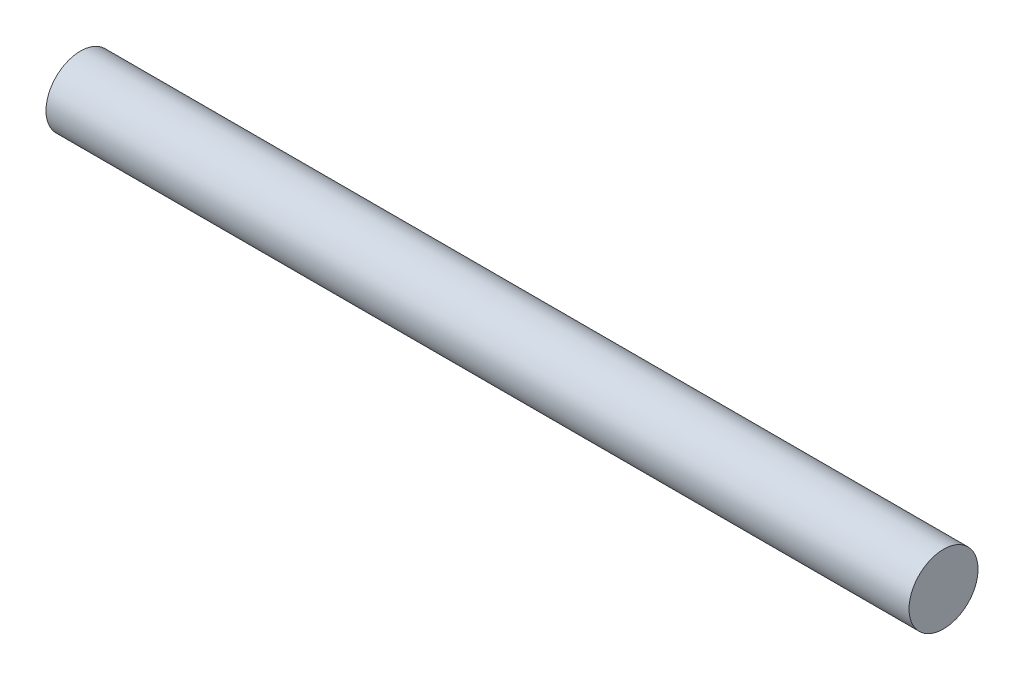
ISO-10303-21;
HEADER;
FILE_DESCRIPTION(('STEP AP214'),'2;1');
FILE_NAME('part.step','',(''),(''),'','','');
FILE_SCHEMA(('AUTOMOTIVE_DESIGN { 1 0 10303 214 1 1 1 1 }'));
ENDSEC;
DATA;
#1=APPLICATION_CONTEXT('core data for automotive mechanical design processes');
#2=APPLICATION_PROTOCOL_DEFINITION('international standard','automotive_design',2000,#1);
#3=PRODUCT_CONTEXT('',#1,'mechanical');
#4=PRODUCT('Part','Part','',(#3));
#5=PRODUCT_RELATED_PRODUCT_CATEGORY('part','',(#4));
#6=PRODUCT_DEFINITION_FORMATION('','',#4);
#7=PRODUCT_DEFINITION_CONTEXT('part definition',#1,'design');
#8=PRODUCT_DEFINITION('design','',#6,#7);
#9=PRODUCT_DEFINITION_SHAPE('','',#8);
#10=(LENGTH_UNIT() NAMED_UNIT(*) SI_UNIT(.MILLI.,.METRE.));
#11=(NAMED_UNIT(*) PLANE_ANGLE_UNIT() SI_UNIT($,.RADIAN.));
#12=(NAMED_UNIT(*) SI_UNIT($,.STERADIAN.) SOLID_ANGLE_UNIT());
#13=UNCERTAINTY_MEASURE_WITH_UNIT(LENGTH_MEASURE(1.E-05),#10,'distance_accuracy_value','');
#14=(GEOMETRIC_REPRESENTATION_CONTEXT(3) GLOBAL_UNCERTAINTY_ASSIGNED_CONTEXT((#13)) GLOBAL_UNIT_ASSIGNED_CONTEXT((#10,
#11,#12)) REPRESENTATION_CONTEXT('',''));
#15=CARTESIAN_POINT('',(0.,0.,0.));
#16=DIRECTION('',(0.,0.,1.));
#17=DIRECTION('',(1.,0.,0.));
#18=AXIS2_PLACEMENT_3D('',#15,#16,#17);
#19=CARTESIAN_POINT('',(0.,0.,0.));
#20=DIRECTION('',(1.,0.,0.));
#21=DIRECTION('',(0.,0.,-1.));
#22=AXIS2_PLACEMENT_3D('',#19,#20,#21);
#23=PLANE('',#22);
#24=CARTESIAN_POINT('',(0.,0.,0.));
#25=DIRECTION('',(-1.,0.,0.));
#26=DIRECTION('',(0.,0.,1.));
#27=AXIS2_PLACEMENT_3D('',#24,#25,#26);
#28=CIRCLE('',#27,4.);
#29=CARTESIAN_POINT('',(0.,0.,4.));
#30=VERTEX_POINT('',#29);
#31=EDGE_CURVE('E10',#30,#30,#28,.T.);
#32=ORIENTED_EDGE('',*,*,#31,.T.);
#33=EDGE_LOOP('',(#32));
#34=FACE_BOUND('',#33,.T.);
#35=ADVANCED_FACE('F30',(#34),#23,.F.);
#36=CARTESIAN_POINT('',(0.,0.,0.));
#37=DIRECTION('',(-1.,0.,0.));
#38=DIRECTION('',(0.,0.,1.));
#39=AXIS2_PLACEMENT_3D('',#36,#37,#38);
#40=CYLINDRICAL_SURFACE('',#39,4.);
#41=ORIENTED_EDGE('',*,*,#31,.F.);
#42=EDGE_LOOP('',(#41));
#43=FACE_BOUND('',#42,.T.);
#44=CARTESIAN_POINT('',(100.,0.,0.));
#45=DIRECTION('',(-1.,0.,0.));
#46=DIRECTION('',(0.,0.,1.));
#47=AXIS2_PLACEMENT_3D('',#44,#45,#46);
#48=CIRCLE('',#47,4.);
#49=CARTESIAN_POINT('',(100.,0.,4.));
#50=VERTEX_POINT('',#49);
#51=EDGE_CURVE('E36',#50,#50,#48,.T.);
#52=ORIENTED_EDGE('',*,*,#51,.T.);
#53=EDGE_LOOP('',(#52));
#54=FACE_BOUND('',#53,.T.);
#55=ADVANCED_FACE('F42',(#43,#54),#40,.T.);
#56=CARTESIAN_POINT('',(100.,0.,0.));
#57=DIRECTION('',(-1.,0.,0.));
#58=DIRECTION('',(0.,0.,1.));
#59=AXIS2_PLACEMENT_3D('',#56,#57,#58);
#60=PLANE('',#59);
#61=ORIENTED_EDGE('',*,*,#51,.F.);
#62=EDGE_LOOP('',(#61));
#63=FACE_BOUND('',#62,.T.);
#64=ADVANCED_FACE('F44',(#63),#60,.F.);
#65=CLOSED_SHELL('',(#35,#55,#64));
#66=MANIFOLD_SOLID_BREP('B2',#65);
#67=ADVANCED_BREP_SHAPE_REPRESENTATION('',(#18,#66),#14);
#68=SHAPE_DEFINITION_REPRESENTATION(#9,#67);
ENDSEC;
END-ISO-10303-21;
